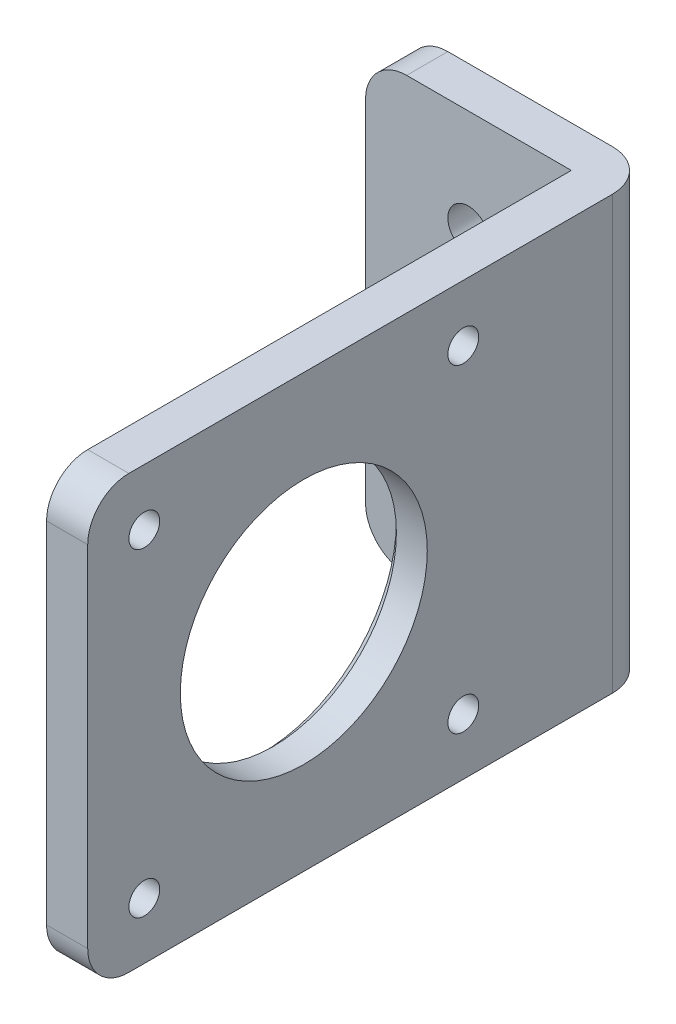
ISO-10303-21;
HEADER;
FILE_DESCRIPTION(('STEP AP214'),'2;1');
FILE_NAME('part.step','',(''),(''),'','','');
FILE_SCHEMA(('AUTOMOTIVE_DESIGN { 1 0 10303 214 1 1 1 1 }'));
ENDSEC;
DATA;
#1=APPLICATION_CONTEXT('core data for automotive mechanical design processes');
#2=APPLICATION_PROTOCOL_DEFINITION('international standard','automotive_design',2000,#1);
#3=PRODUCT_CONTEXT('',#1,'mechanical');
#4=PRODUCT('Part','Part','',(#3));
#5=PRODUCT_RELATED_PRODUCT_CATEGORY('part','',(#4));
#6=PRODUCT_DEFINITION_FORMATION('','',#4);
#7=PRODUCT_DEFINITION_CONTEXT('part definition',#1,'design');
#8=PRODUCT_DEFINITION('design','',#6,#7);
#9=PRODUCT_DEFINITION_SHAPE('','',#8);
#10=(LENGTH_UNIT() NAMED_UNIT(*) SI_UNIT(.MILLI.,.METRE.));
#11=(NAMED_UNIT(*) PLANE_ANGLE_UNIT() SI_UNIT($,.RADIAN.));
#12=(NAMED_UNIT(*) SI_UNIT($,.STERADIAN.) SOLID_ANGLE_UNIT());
#13=UNCERTAINTY_MEASURE_WITH_UNIT(LENGTH_MEASURE(1.E-05),#10,'distance_accuracy_value','');
#14=(GEOMETRIC_REPRESENTATION_CONTEXT(3) GLOBAL_UNCERTAINTY_ASSIGNED_CONTEXT((#13)) GLOBAL_UNIT_ASSIGNED_CONTEXT((#10,
#11,#12)) REPRESENTATION_CONTEXT('',''));
#15=CARTESIAN_POINT('',(0.,0.,0.));
#16=DIRECTION('',(0.,0.,1.));
#17=DIRECTION('',(1.,0.,0.));
#18=AXIS2_PLACEMENT_3D('',#15,#16,#17);
#19=CARTESIAN_POINT('',(-20.,42.,-55.));
#20=DIRECTION('',(0.,0.,1.));
#21=DIRECTION('',(1.,0.,0.));
#22=AXIS2_PLACEMENT_3D('',#19,#20,#21);
#23=PLANE('',#22);
#24=DIRECTION('',(-1.,0.,0.));
#25=VECTOR('',#24,1.);
#26=CARTESIAN_POINT('',(-20.,42.,-55.));
#27=LINE('',#26,#25);
#28=CARTESIAN_POINT('',(0.,42.,-55.));
#29=VERTEX_POINT('',#28);
#30=CARTESIAN_POINT('',(-16.,42.,-55.));
#31=VERTEX_POINT('',#30);
#32=EDGE_CURVE('E140',#29,#31,#27,.T.);
#33=ORIENTED_EDGE('',*,*,#32,.F.);
#34=DIRECTION('',(0.,-1.,0.));
#35=VECTOR('',#34,1.);
#36=CARTESIAN_POINT('',(0.,42.,-55.));
#37=LINE('',#36,#35);
#38=CARTESIAN_POINT('',(0.,0.,-55.));
#39=VERTEX_POINT('',#38);
#40=EDGE_CURVE('E206',#29,#39,#37,.T.);
#41=ORIENTED_EDGE('',*,*,#40,.T.);
#42=DIRECTION('',(-1.,0.,0.));
#43=VECTOR('',#42,1.);
#44=CARTESIAN_POINT('',(-20.,0.,-55.));
#45=LINE('',#44,#43);
#46=CARTESIAN_POINT('',(-16.,0.,-55.));
#47=VERTEX_POINT('',#46);
#48=EDGE_CURVE('E171',#39,#47,#45,.T.);
#49=ORIENTED_EDGE('',*,*,#48,.T.);
#50=CARTESIAN_POINT('',(-16.,4.,-55.));
#51=DIRECTION('',(0.,0.,1.));
#52=DIRECTION('',(1.,0.,0.));
#53=AXIS2_PLACEMENT_3D('',#50,#51,#52);
#54=CIRCLE('',#53,4.);
#55=CARTESIAN_POINT('',(-20.,4.00000000000001,-55.));
#56=VERTEX_POINT('',#55);
#57=EDGE_CURVE('E203',#47,#56,#54,.F.);
#58=ORIENTED_EDGE('',*,*,#57,.T.);
#59=DIRECTION('',(0.,-1.,0.));
#60=VECTOR('',#59,1.);
#61=CARTESIAN_POINT('',(-20.,42.,-55.));
#62=LINE('',#61,#60);
#63=CARTESIAN_POINT('',(-20.,38.,-55.));
#64=VERTEX_POINT('',#63);
#65=EDGE_CURVE('E184',#64,#56,#62,.T.);
#66=ORIENTED_EDGE('',*,*,#65,.F.);
#67=CARTESIAN_POINT('',(-16.,38.,-55.));
#68=DIRECTION('',(0.,0.,1.));
#69=DIRECTION('',(1.,0.,0.));
#70=AXIS2_PLACEMENT_3D('',#67,#68,#69);
#71=CIRCLE('',#70,4.);
#72=EDGE_CURVE('E200',#64,#31,#71,.F.);
#73=ORIENTED_EDGE('',*,*,#72,.T.);
#74=EDGE_LOOP('',(#33,#41,#49,#58,#66,#73));
#75=FACE_BOUND('',#74,.T.);
#76=CARTESIAN_POINT('',(-10.,9.99999999999999,-55.));
#77=DIRECTION('',(0.,0.,1.));
#78=DIRECTION('',(1.,0.,0.));
#79=AXIS2_PLACEMENT_3D('',#76,#77,#78);
#80=CIRCLE('',#79,2.);
#81=CARTESIAN_POINT('',(-8.00000000000003,9.99999999999999,-55.));
#82=VERTEX_POINT('',#81);
#83=EDGE_CURVE('E318',#82,#82,#80,.F.);
#84=ORIENTED_EDGE('',*,*,#83,.F.);
#85=EDGE_LOOP('',(#84));
#86=FACE_BOUND('',#85,.T.);
#87=CARTESIAN_POINT('',(-10.,32.,-55.));
#88=DIRECTION('',(0.,0.,1.));
#89=DIRECTION('',(1.,0.,0.));
#90=AXIS2_PLACEMENT_3D('',#87,#88,#89);
#91=CIRCLE('',#90,2.);
#92=CARTESIAN_POINT('',(-8.,32.,-55.));
#93=VERTEX_POINT('',#92);
#94=EDGE_CURVE('E291',#93,#93,#91,.T.);
#95=ORIENTED_EDGE('',*,*,#94,.T.);
#96=EDGE_LOOP('',(#95));
#97=FACE_BOUND('',#96,.T.);
#98=ADVANCED_FACE('F45',(#75,#86,#97),#23,.F.);
#99=CARTESIAN_POINT('',(0.,42.,-51.));
#100=DIRECTION('',(0.,0.,-1.));
#101=DIRECTION('',(-1.,0.,0.));
#102=AXIS2_PLACEMENT_3D('',#99,#100,#101);
#103=PLANE('',#102);
#104=DIRECTION('',(0.,-1.,0.));
#105=VECTOR('',#104,1.);
#106=CARTESIAN_POINT('',(-20.,42.,-51.));
#107=LINE('',#106,#105);
#108=CARTESIAN_POINT('',(-20.,38.,-51.));
#109=VERTEX_POINT('',#108);
#110=CARTESIAN_POINT('',(-20.,4.00000000000001,-51.));
#111=VERTEX_POINT('',#110);
#112=EDGE_CURVE('E152',#109,#111,#107,.T.);
#113=ORIENTED_EDGE('',*,*,#112,.T.);
#114=CARTESIAN_POINT('',(-16.,4.,-51.));
#115=DIRECTION('',(0.,0.,-1.));
#116=DIRECTION('',(-1.,0.,0.));
#117=AXIS2_PLACEMENT_3D('',#114,#115,#116);
#118=CIRCLE('',#117,4.);
#119=CARTESIAN_POINT('',(-16.,0.,-51.));
#120=VERTEX_POINT('',#119);
#121=EDGE_CURVE('E12',#111,#120,#118,.F.);
#122=ORIENTED_EDGE('',*,*,#121,.T.);
#123=DIRECTION('',(1.,0.,0.));
#124=VECTOR('',#123,1.);
#125=CARTESIAN_POINT('',(0.,0.,-51.));
#126=LINE('',#125,#124);
#127=CARTESIAN_POINT('',(0.,0.,-51.));
#128=VERTEX_POINT('',#127);
#129=EDGE_CURVE('E147',#120,#128,#126,.T.);
#130=ORIENTED_EDGE('',*,*,#129,.T.);
#131=DIRECTION('',(0.,-1.,0.));
#132=VECTOR('',#131,1.);
#133=CARTESIAN_POINT('',(0.,42.,-51.));
#134=LINE('',#133,#132);
#135=CARTESIAN_POINT('',(0.,42.,-51.));
#136=VERTEX_POINT('',#135);
#137=EDGE_CURVE('E143',#136,#128,#134,.T.);
#138=ORIENTED_EDGE('',*,*,#137,.F.);
#139=DIRECTION('',(1.,0.,0.));
#140=VECTOR('',#139,1.);
#141=CARTESIAN_POINT('',(0.,42.,-51.));
#142=LINE('',#141,#140);
#143=CARTESIAN_POINT('',(-16.,42.,-51.));
#144=VERTEX_POINT('',#143);
#145=EDGE_CURVE('E128',#144,#136,#142,.T.);
#146=ORIENTED_EDGE('',*,*,#145,.F.);
#147=CARTESIAN_POINT('',(-16.,38.,-51.));
#148=DIRECTION('',(0.,0.,-1.));
#149=DIRECTION('',(-1.,0.,0.));
#150=AXIS2_PLACEMENT_3D('',#147,#148,#149);
#151=CIRCLE('',#150,4.);
#152=EDGE_CURVE('E54',#144,#109,#151,.F.);
#153=ORIENTED_EDGE('',*,*,#152,.T.);
#154=EDGE_LOOP('',(#113,#122,#130,#138,#146,#153));
#155=FACE_BOUND('',#154,.T.);
#156=CARTESIAN_POINT('',(-10.,9.99999999999999,-51.));
#157=DIRECTION('',(0.,0.,1.));
#158=DIRECTION('',(1.,0.,0.));
#159=AXIS2_PLACEMENT_3D('',#156,#157,#158);
#160=CIRCLE('',#159,2.);
#161=CARTESIAN_POINT('',(-8.00000000000003,9.99999999999999,-51.));
#162=VERTEX_POINT('',#161);
#163=EDGE_CURVE('E322',#162,#162,#160,.F.);
#164=ORIENTED_EDGE('',*,*,#163,.T.);
#165=EDGE_LOOP('',(#164));
#166=FACE_BOUND('',#165,.T.);
#167=CARTESIAN_POINT('',(-10.,32.,-51.));
#168=DIRECTION('',(0.,0.,1.));
#169=DIRECTION('',(1.,0.,0.));
#170=AXIS2_PLACEMENT_3D('',#167,#168,#169);
#171=CIRCLE('',#170,2.);
#172=CARTESIAN_POINT('',(-8.,32.,-51.));
#173=VERTEX_POINT('',#172);
#174=EDGE_CURVE('E326',#173,#173,#171,.T.);
#175=ORIENTED_EDGE('',*,*,#174,.F.);
#176=EDGE_LOOP('',(#175));
#177=FACE_BOUND('',#176,.T.);
#178=ADVANCED_FACE('F144',(#155,#166,#177),#103,.F.);
#179=CARTESIAN_POINT('',(3.99999999999999,42.,-55.));
#180=DIRECTION('',(-1.,0.,0.));
#181=DIRECTION('',(0.,0.,1.));
#182=AXIS2_PLACEMENT_3D('',#179,#180,#181);
#183=PLANE('',#182);
#184=CARTESIAN_POINT('',(4.,5.5,-36.5));
#185=DIRECTION('',(-1.,0.,0.));
#186=DIRECTION('',(0.,0.,1.));
#187=AXIS2_PLACEMENT_3D('',#184,#185,#186);
#188=CIRCLE('',#187,1.5);
#189=CARTESIAN_POINT('',(4.,5.5,-35.));
#190=VERTEX_POINT('',#189);
#191=EDGE_CURVE('E286',#190,#190,#188,.T.);
#192=ORIENTED_EDGE('',*,*,#191,.T.);
#193=EDGE_LOOP('',(#192));
#194=FACE_BOUND('',#193,.T.);
#195=CARTESIAN_POINT('',(4.,36.5,-5.50000000000004));
#196=DIRECTION('',(-1.,0.,0.));
#197=DIRECTION('',(0.,0.,1.));
#198=AXIS2_PLACEMENT_3D('',#195,#196,#197);
#199=CIRCLE('',#198,1.5);
#200=CARTESIAN_POINT('',(4.,36.5,-4.00000000000004));
#201=VERTEX_POINT('',#200);
#202=EDGE_CURVE('E303',#201,#201,#199,.T.);
#203=ORIENTED_EDGE('',*,*,#202,.T.);
#204=EDGE_LOOP('',(#203));
#205=FACE_BOUND('',#204,.T.);
#206=CARTESIAN_POINT('',(4.,21.,-21.));
#207=DIRECTION('',(-1.,0.,0.));
#208=DIRECTION('',(0.,0.,1.));
#209=AXIS2_PLACEMENT_3D('',#206,#207,#208);
#210=CIRCLE('',#209,12.);
#211=CARTESIAN_POINT('',(4.,21.,-9.00000000000001));
#212=VERTEX_POINT('',#211);
#213=EDGE_CURVE('E172',#212,#212,#210,.T.);
#214=ORIENTED_EDGE('',*,*,#213,.T.);
#215=EDGE_LOOP('',(#214));
#216=FACE_BOUND('',#215,.T.);
#217=DIRECTION('',(0.,0.,-1.));
#218=VECTOR('',#217,1.);
#219=CARTESIAN_POINT('',(3.99999999999999,0.,-55.));
#220=LINE('',#219,#218);
#221=CARTESIAN_POINT('',(4.,0.,-4.));
#222=VERTEX_POINT('',#221);
#223=CARTESIAN_POINT('',(3.99999999999999,0.,-51.));
#224=VERTEX_POINT('',#223);
#225=EDGE_CURVE('E167',#222,#224,#220,.T.);
#226=ORIENTED_EDGE('',*,*,#225,.T.);
#227=DIRECTION('',(0.,-1.,0.));
#228=VECTOR('',#227,1.);
#229=CARTESIAN_POINT('',(3.99999999999999,42.,-51.));
#230=LINE('',#229,#228);
#231=CARTESIAN_POINT('',(3.99999999999999,42.,-51.));
#232=VERTEX_POINT('',#231);
#233=EDGE_CURVE('E225',#224,#232,#230,.F.);
#234=ORIENTED_EDGE('',*,*,#233,.T.);
#235=DIRECTION('',(0.,0.,-1.));
#236=VECTOR('',#235,1.);
#237=CARTESIAN_POINT('',(3.99999999999999,42.,-55.));
#238=LINE('',#237,#236);
#239=CARTESIAN_POINT('',(4.,42.,-4.));
#240=VERTEX_POINT('',#239);
#241=EDGE_CURVE('E180',#240,#232,#238,.T.);
#242=ORIENTED_EDGE('',*,*,#241,.F.);
#243=CARTESIAN_POINT('',(4.,38.,-4.));
#244=DIRECTION('',(-1.,0.,0.));
#245=DIRECTION('',(0.,0.,1.));
#246=AXIS2_PLACEMENT_3D('',#243,#244,#245);
#247=CIRCLE('',#246,4.);
#248=CARTESIAN_POINT('',(4.,38.,0.));
#249=VERTEX_POINT('',#248);
#250=EDGE_CURVE('E219',#240,#249,#247,.F.);
#251=ORIENTED_EDGE('',*,*,#250,.T.);
#252=DIRECTION('',(0.,-1.,0.));
#253=VECTOR('',#252,1.);
#254=CARTESIAN_POINT('',(4.,42.,0.));
#255=LINE('',#254,#253);
#256=CARTESIAN_POINT('',(4.,4.00000000000001,0.));
#257=VERTEX_POINT('',#256);
#258=EDGE_CURVE('E188',#249,#257,#255,.T.);
#259=ORIENTED_EDGE('',*,*,#258,.T.);
#260=CARTESIAN_POINT('',(4.,4.,-4.));
#261=DIRECTION('',(-1.,0.,0.));
#262=DIRECTION('',(0.,0.,1.));
#263=AXIS2_PLACEMENT_3D('',#260,#261,#262);
#264=CIRCLE('',#263,4.);
#265=EDGE_CURVE('E222',#257,#222,#264,.F.);
#266=ORIENTED_EDGE('',*,*,#265,.T.);
#267=EDGE_LOOP('',(#226,#234,#242,#251,#259,#266));
#268=FACE_BOUND('',#267,.T.);
#269=CARTESIAN_POINT('',(4.,36.5,-36.5));
#270=DIRECTION('',(-1.,0.,0.));
#271=DIRECTION('',(0.,0.,1.));
#272=AXIS2_PLACEMENT_3D('',#269,#270,#271);
#273=CIRCLE('',#272,1.5);
#274=CARTESIAN_POINT('',(4.,36.5,-35.));
#275=VERTEX_POINT('',#274);
#276=EDGE_CURVE('E311',#275,#275,#273,.F.);
#277=ORIENTED_EDGE('',*,*,#276,.F.);
#278=EDGE_LOOP('',(#277));
#279=FACE_BOUND('',#278,.T.);
#280=CARTESIAN_POINT('',(4.,5.5,-5.50000000000001));
#281=DIRECTION('',(-1.,0.,0.));
#282=DIRECTION('',(0.,0.,1.));
#283=AXIS2_PLACEMENT_3D('',#280,#281,#282);
#284=CIRCLE('',#283,1.5);
#285=CARTESIAN_POINT('',(4.,5.5,-4.00000000000001));
#286=VERTEX_POINT('',#285);
#287=EDGE_CURVE('E295',#286,#286,#284,.F.);
#288=ORIENTED_EDGE('',*,*,#287,.F.);
#289=EDGE_LOOP('',(#288));
#290=FACE_BOUND('',#289,.T.);
#291=ADVANCED_FACE('F273',(#194,#205,#216,#268,#279,#290),#183,.F.);
#292=CARTESIAN_POINT('',(0.,42.,0.));
#293=DIRECTION('',(1.,0.,0.));
#294=DIRECTION('',(0.,0.,-1.));
#295=AXIS2_PLACEMENT_3D('',#292,#293,#294);
#296=PLANE('',#295);
#297=CARTESIAN_POINT('',(0.,21.,-21.));
#298=DIRECTION('',(1.,0.,0.));
#299=DIRECTION('',(0.,0.,-1.));
#300=AXIS2_PLACEMENT_3D('',#297,#298,#299);
#301=CIRCLE('',#300,13.);
#302=CARTESIAN_POINT('',(0.,21.,-34.));
#303=VERTEX_POINT('',#302);
#304=EDGE_CURVE('E196',#303,#303,#301,.T.);
#305=ORIENTED_EDGE('',*,*,#304,.T.);
#306=EDGE_LOOP('',(#305));
#307=FACE_BOUND('',#306,.T.);
#308=CARTESIAN_POINT('',(0.,5.5,-36.5));
#309=DIRECTION('',(-1.,0.,0.));
#310=DIRECTION('',(0.,0.,1.));
#311=AXIS2_PLACEMENT_3D('',#308,#309,#310);
#312=CIRCLE('',#311,1.5);
#313=CARTESIAN_POINT('',(0.,5.5,-35.));
#314=VERTEX_POINT('',#313);
#315=EDGE_CURVE('E290',#314,#314,#312,.T.);
#316=ORIENTED_EDGE('',*,*,#315,.F.);
#317=EDGE_LOOP('',(#316));
#318=FACE_BOUND('',#317,.T.);
#319=CARTESIAN_POINT('',(0.,36.5,-5.50000000000004));
#320=DIRECTION('',(-1.,0.,0.));
#321=DIRECTION('',(0.,0.,1.));
#322=AXIS2_PLACEMENT_3D('',#319,#320,#321);
#323=CIRCLE('',#322,1.5);
#324=CARTESIAN_POINT('',(0.,36.5,-4.00000000000004));
#325=VERTEX_POINT('',#324);
#326=EDGE_CURVE('E307',#325,#325,#323,.T.);
#327=ORIENTED_EDGE('',*,*,#326,.F.);
#328=EDGE_LOOP('',(#327));
#329=FACE_BOUND('',#328,.T.);
#330=DIRECTION('',(0.,0.,1.));
#331=VECTOR('',#330,1.);
#332=CARTESIAN_POINT('',(0.,0.,0.));
#333=LINE('',#332,#331);
#334=CARTESIAN_POINT('',(0.,0.,-4.));
#335=VERTEX_POINT('',#334);
#336=EDGE_CURVE('E178',#128,#335,#333,.T.);
#337=ORIENTED_EDGE('',*,*,#336,.T.);
#338=CARTESIAN_POINT('',(0.,4.,-4.));
#339=DIRECTION('',(1.,0.,0.));
#340=DIRECTION('',(0.,0.,-1.));
#341=AXIS2_PLACEMENT_3D('',#338,#339,#340);
#342=CIRCLE('',#341,4.);
#343=CARTESIAN_POINT('',(0.,4.00000000000001,0.));
#344=VERTEX_POINT('',#343);
#345=EDGE_CURVE('E245',#335,#344,#342,.F.);
#346=ORIENTED_EDGE('',*,*,#345,.T.);
#347=DIRECTION('',(0.,-1.,0.));
#348=VECTOR('',#347,1.);
#349=CARTESIAN_POINT('',(0.,42.,0.));
#350=LINE('',#349,#348);
#351=CARTESIAN_POINT('',(0.,38.,0.));
#352=VERTEX_POINT('',#351);
#353=EDGE_CURVE('E153',#352,#344,#350,.T.);
#354=ORIENTED_EDGE('',*,*,#353,.F.);
#355=CARTESIAN_POINT('',(0.,38.,-4.));
#356=DIRECTION('',(1.,0.,0.));
#357=DIRECTION('',(0.,0.,-1.));
#358=AXIS2_PLACEMENT_3D('',#355,#356,#357);
#359=CIRCLE('',#358,4.);
#360=CARTESIAN_POINT('',(0.,42.,-4.));
#361=VERTEX_POINT('',#360);
#362=EDGE_CURVE('E159',#352,#361,#359,.F.);
#363=ORIENTED_EDGE('',*,*,#362,.T.);
#364=DIRECTION('',(0.,0.,1.));
#365=VECTOR('',#364,1.);
#366=CARTESIAN_POINT('',(0.,42.,0.));
#367=LINE('',#366,#365);
#368=EDGE_CURVE('E134',#136,#361,#367,.T.);
#369=ORIENTED_EDGE('',*,*,#368,.F.);
#370=ORIENTED_EDGE('',*,*,#137,.T.);
#371=EDGE_LOOP('',(#337,#346,#354,#363,#369,#370));
#372=FACE_BOUND('',#371,.T.);
#373=CARTESIAN_POINT('',(0.,36.5,-36.5));
#374=DIRECTION('',(-1.,0.,0.));
#375=DIRECTION('',(0.,0.,1.));
#376=AXIS2_PLACEMENT_3D('',#373,#374,#375);
#377=CIRCLE('',#376,1.5);
#378=CARTESIAN_POINT('',(0.,36.5,-35.));
#379=VERTEX_POINT('',#378);
#380=EDGE_CURVE('E285',#379,#379,#377,.F.);
#381=ORIENTED_EDGE('',*,*,#380,.T.);
#382=EDGE_LOOP('',(#381));
#383=FACE_BOUND('',#382,.T.);
#384=CARTESIAN_POINT('',(0.,5.5,-5.50000000000001));
#385=DIRECTION('',(-1.,0.,0.));
#386=DIRECTION('',(0.,0.,1.));
#387=AXIS2_PLACEMENT_3D('',#384,#385,#386);
#388=CIRCLE('',#387,1.5);
#389=CARTESIAN_POINT('',(0.,5.5,-4.00000000000001));
#390=VERTEX_POINT('',#389);
#391=EDGE_CURVE('E299',#390,#390,#388,.F.);
#392=ORIENTED_EDGE('',*,*,#391,.T.);
#393=EDGE_LOOP('',(#392));
#394=FACE_BOUND('',#393,.T.);
#395=ADVANCED_FACE('F155',(#307,#318,#329,#372,#383,#394),#296,.F.);
#396=CARTESIAN_POINT('',(4.,42.,0.));
#397=DIRECTION('',(0.,0.,-1.));
#398=DIRECTION('',(-1.,0.,0.));
#399=AXIS2_PLACEMENT_3D('',#396,#397,#398);
#400=PLANE('',#399);
#401=ORIENTED_EDGE('',*,*,#353,.T.);
#402=DIRECTION('',(1.,0.,0.));
#403=VECTOR('',#402,1.);
#404=CARTESIAN_POINT('',(4.,4.,0.));
#405=LINE('',#404,#403);
#406=EDGE_CURVE('E239',#344,#257,#405,.T.);
#407=ORIENTED_EDGE('',*,*,#406,.T.);
#408=ORIENTED_EDGE('',*,*,#258,.F.);
#409=DIRECTION('',(1.,0.,0.));
#410=VECTOR('',#409,1.);
#411=CARTESIAN_POINT('',(4.,38.,0.));
#412=LINE('',#411,#410);
#413=EDGE_CURVE('E236',#249,#352,#412,.F.);
#414=ORIENTED_EDGE('',*,*,#413,.T.);
#415=EDGE_LOOP('',(#401,#407,#408,#414));
#416=FACE_BOUND('',#415,.T.);
#417=ADVANCED_FACE('F356',(#416),#400,.F.);
#418=CARTESIAN_POINT('',(-20.,42.,-51.));
#419=DIRECTION('',(1.,0.,0.));
#420=DIRECTION('',(0.,0.,-1.));
#421=AXIS2_PLACEMENT_3D('',#418,#419,#420);
#422=PLANE('',#421);
#423=ORIENTED_EDGE('',*,*,#65,.T.);
#424=DIRECTION('',(0.,0.,1.));
#425=VECTOR('',#424,1.);
#426=CARTESIAN_POINT('',(-20.,4.,-51.));
#427=LINE('',#426,#425);
#428=EDGE_CURVE('E251',#56,#111,#427,.T.);
#429=ORIENTED_EDGE('',*,*,#428,.T.);
#430=ORIENTED_EDGE('',*,*,#112,.F.);
#431=DIRECTION('',(0.,0.,1.));
#432=VECTOR('',#431,1.);
#433=CARTESIAN_POINT('',(-20.,38.,-51.));
#434=LINE('',#433,#432);
#435=EDGE_CURVE('E248',#109,#64,#434,.F.);
#436=ORIENTED_EDGE('',*,*,#435,.T.);
#437=EDGE_LOOP('',(#423,#429,#430,#436));
#438=FACE_BOUND('',#437,.T.);
#439=ADVANCED_FACE('F255',(#438),#422,.F.);
#440=CARTESIAN_POINT('',(0.,42.,0.));
#441=DIRECTION('',(0.,-1.,0.));
#442=DIRECTION('',(0.,0.,-1.));
#443=AXIS2_PLACEMENT_3D('',#440,#441,#442);
#444=PLANE('',#443);
#445=ORIENTED_EDGE('',*,*,#241,.T.);
#446=CARTESIAN_POINT('',(0.,42.,-51.));
#447=DIRECTION('',(0.,-1.,0.));
#448=DIRECTION('',(0.,0.,-1.));
#449=AXIS2_PLACEMENT_3D('',#446,#447,#448);
#450=CIRCLE('',#449,4.);
#451=EDGE_CURVE('E233',#232,#29,#450,.F.);
#452=ORIENTED_EDGE('',*,*,#451,.T.);
#453=ORIENTED_EDGE('',*,*,#32,.T.);
#454=DIRECTION('',(0.,0.,1.));
#455=VECTOR('',#454,1.);
#456=CARTESIAN_POINT('',(-16.,42.,0.));
#457=LINE('',#456,#455);
#458=EDGE_CURVE('E138',#31,#144,#457,.T.);
#459=ORIENTED_EDGE('',*,*,#458,.T.);
#460=ORIENTED_EDGE('',*,*,#145,.T.);
#461=ORIENTED_EDGE('',*,*,#368,.T.);
#462=DIRECTION('',(1.,0.,0.));
#463=VECTOR('',#462,1.);
#464=CARTESIAN_POINT('',(0.,42.,-4.));
#465=LINE('',#464,#463);
#466=EDGE_CURVE('E230',#361,#240,#465,.T.);
#467=ORIENTED_EDGE('',*,*,#466,.T.);
#468=EDGE_LOOP('',(#445,#452,#453,#459,#460,#461,#467));
#469=FACE_BOUND('',#468,.T.);
#470=ADVANCED_FACE('F131',(#469),#444,.F.);
#471=CARTESIAN_POINT('',(0.,0.,0.));
#472=DIRECTION('',(0.,-1.,0.));
#473=DIRECTION('',(0.,0.,-1.));
#474=AXIS2_PLACEMENT_3D('',#471,#472,#473);
#475=PLANE('',#474);
#476=ORIENTED_EDGE('',*,*,#48,.F.);
#477=CARTESIAN_POINT('',(0.,0.,-51.));
#478=DIRECTION('',(0.,-1.,0.));
#479=DIRECTION('',(0.,0.,-1.));
#480=AXIS2_PLACEMENT_3D('',#477,#478,#479);
#481=CIRCLE('',#480,4.);
#482=EDGE_CURVE('E216',#39,#224,#481,.T.);
#483=ORIENTED_EDGE('',*,*,#482,.T.);
#484=ORIENTED_EDGE('',*,*,#225,.F.);
#485=DIRECTION('',(1.,0.,0.));
#486=VECTOR('',#485,1.);
#487=CARTESIAN_POINT('',(0.,0.,-4.));
#488=LINE('',#487,#486);
#489=EDGE_CURVE('E213',#222,#335,#488,.F.);
#490=ORIENTED_EDGE('',*,*,#489,.T.);
#491=ORIENTED_EDGE('',*,*,#336,.F.);
#492=ORIENTED_EDGE('',*,*,#129,.F.);
#493=DIRECTION('',(0.,0.,1.));
#494=VECTOR('',#493,1.);
#495=CARTESIAN_POINT('',(-16.,0.,-55.));
#496=LINE('',#495,#494);
#497=EDGE_CURVE('E210',#120,#47,#496,.F.);
#498=ORIENTED_EDGE('',*,*,#497,.T.);
#499=EDGE_LOOP('',(#476,#483,#484,#490,#491,#492,#498));
#500=FACE_BOUND('',#499,.T.);
#501=ADVANCED_FACE('F261',(#500),#475,.T.);
#502=CARTESIAN_POINT('',(4.,21.,-21.));
#503=DIRECTION('',(-1.,0.,0.));
#504=DIRECTION('',(0.,0.,1.));
#505=AXIS2_PLACEMENT_3D('',#502,#503,#504);
#506=CYLINDRICAL_SURFACE('',#505,12.);
#507=CARTESIAN_POINT('',(1.00000000000002,21.,-21.));
#508=DIRECTION('',(1.,0.,0.));
#509=DIRECTION('',(0.,0.,-1.));
#510=AXIS2_PLACEMENT_3D('',#507,#508,#509);
#511=CIRCLE('',#510,12.);
#512=CARTESIAN_POINT('',(1.00000000000002,21.,-33.));
#513=VERTEX_POINT('',#512);
#514=EDGE_CURVE('E192',#513,#513,#511,.F.);
#515=ORIENTED_EDGE('',*,*,#514,.T.);
#516=EDGE_LOOP('',(#515));
#517=FACE_BOUND('',#516,.T.);
#518=ORIENTED_EDGE('',*,*,#213,.F.);
#519=EDGE_LOOP('',(#518));
#520=FACE_BOUND('',#519,.T.);
#521=ADVANCED_FACE('F412',(#517,#520),#506,.F.);
#522=CARTESIAN_POINT('',(4.,36.5,-36.5));
#523=DIRECTION('',(-1.,0.,0.));
#524=DIRECTION('',(0.,0.,1.));
#525=AXIS2_PLACEMENT_3D('',#522,#523,#524);
#526=CYLINDRICAL_SURFACE('',#525,1.5);
#527=ORIENTED_EDGE('',*,*,#276,.T.);
#528=EDGE_LOOP('',(#527));
#529=FACE_BOUND('',#528,.T.);
#530=ORIENTED_EDGE('',*,*,#380,.F.);
#531=EDGE_LOOP('',(#530));
#532=FACE_BOUND('',#531,.T.);
#533=ADVANCED_FACE('F472',(#529,#532),#526,.F.);
#534=CARTESIAN_POINT('',(4.,36.5,-5.50000000000004));
#535=DIRECTION('',(-1.,0.,0.));
#536=DIRECTION('',(0.,0.,1.));
#537=AXIS2_PLACEMENT_3D('',#534,#535,#536);
#538=CYLINDRICAL_SURFACE('',#537,1.5);
#539=ORIENTED_EDGE('',*,*,#202,.F.);
#540=EDGE_LOOP('',(#539));
#541=FACE_BOUND('',#540,.T.);
#542=ORIENTED_EDGE('',*,*,#326,.T.);
#543=EDGE_LOOP('',(#542));
#544=FACE_BOUND('',#543,.T.);
#545=ADVANCED_FACE('F508',(#541,#544),#538,.F.);
#546=CARTESIAN_POINT('',(4.,5.5,-5.50000000000001));
#547=DIRECTION('',(-1.,0.,0.));
#548=DIRECTION('',(0.,0.,1.));
#549=AXIS2_PLACEMENT_3D('',#546,#547,#548);
#550=CYLINDRICAL_SURFACE('',#549,1.5);
#551=ORIENTED_EDGE('',*,*,#287,.T.);
#552=EDGE_LOOP('',(#551));
#553=FACE_BOUND('',#552,.T.);
#554=ORIENTED_EDGE('',*,*,#391,.F.);
#555=EDGE_LOOP('',(#554));
#556=FACE_BOUND('',#555,.T.);
#557=ADVANCED_FACE('F498',(#553,#556),#550,.F.);
#558=CARTESIAN_POINT('',(4.,5.5,-36.5));
#559=DIRECTION('',(-1.,0.,0.));
#560=DIRECTION('',(0.,0.,1.));
#561=AXIS2_PLACEMENT_3D('',#558,#559,#560);
#562=CYLINDRICAL_SURFACE('',#561,1.5);
#563=ORIENTED_EDGE('',*,*,#191,.F.);
#564=EDGE_LOOP('',(#563));
#565=FACE_BOUND('',#564,.T.);
#566=ORIENTED_EDGE('',*,*,#315,.T.);
#567=EDGE_LOOP('',(#566));
#568=FACE_BOUND('',#567,.T.);
#569=ADVANCED_FACE('F489',(#565,#568),#562,.F.);
#570=CARTESIAN_POINT('',(-10.,9.99999999999999,-55.));
#571=DIRECTION('',(0.,0.,1.));
#572=DIRECTION('',(1.,0.,0.));
#573=AXIS2_PLACEMENT_3D('',#570,#571,#572);
#574=CYLINDRICAL_SURFACE('',#573,2.);
#575=ORIENTED_EDGE('',*,*,#83,.T.);
#576=EDGE_LOOP('',(#575));
#577=FACE_BOUND('',#576,.T.);
#578=ORIENTED_EDGE('',*,*,#163,.F.);
#579=EDGE_LOOP('',(#578));
#580=FACE_BOUND('',#579,.T.);
#581=ADVANCED_FACE('F339',(#577,#580),#574,.F.);
#582=CARTESIAN_POINT('',(-10.,32.,-55.));
#583=DIRECTION('',(0.,0.,1.));
#584=DIRECTION('',(1.,0.,0.));
#585=AXIS2_PLACEMENT_3D('',#582,#583,#584);
#586=CYLINDRICAL_SURFACE('',#585,2.);
#587=ORIENTED_EDGE('',*,*,#94,.F.);
#588=EDGE_LOOP('',(#587));
#589=FACE_BOUND('',#588,.T.);
#590=ORIENTED_EDGE('',*,*,#174,.T.);
#591=EDGE_LOOP('',(#590));
#592=FACE_BOUND('',#591,.T.);
#593=ADVANCED_FACE('F335',(#589,#592),#586,.F.);
#594=CARTESIAN_POINT('',(1.00000000000002,21.,-21.));
#595=DIRECTION('',(-1.,0.,0.));
#596=DIRECTION('',(0.,0.,1.));
#597=AXIS2_PLACEMENT_3D('',#594,#595,#596);
#598=CONICAL_SURFACE('',#597,12.,0.785398163397455);
#599=ORIENTED_EDGE('',*,*,#304,.F.);
#600=EDGE_LOOP('',(#599));
#601=FACE_BOUND('',#600,.T.);
#602=ORIENTED_EDGE('',*,*,#514,.F.);
#603=EDGE_LOOP('',(#602));
#604=FACE_BOUND('',#603,.T.);
#605=ADVANCED_FACE('F338',(#601,#604),#598,.F.);
#606=CARTESIAN_POINT('',(0.,42.,-51.));
#607=DIRECTION('',(0.,-1.,0.));
#608=DIRECTION('',(0.,0.,-1.));
#609=AXIS2_PLACEMENT_3D('',#606,#607,#608);
#610=CYLINDRICAL_SURFACE('',#609,4.);
#611=ORIENTED_EDGE('',*,*,#451,.F.);
#612=ORIENTED_EDGE('',*,*,#233,.F.);
#613=ORIENTED_EDGE('',*,*,#482,.F.);
#614=ORIENTED_EDGE('',*,*,#40,.F.);
#615=EDGE_LOOP('',(#611,#612,#613,#614));
#616=FACE_BOUND('',#615,.T.);
#617=ADVANCED_FACE('F277',(#616),#610,.T.);
#618=CARTESIAN_POINT('',(4.,4.,-4.));
#619=DIRECTION('',(-1.,0.,0.));
#620=DIRECTION('',(0.,0.,1.));
#621=AXIS2_PLACEMENT_3D('',#618,#619,#620);
#622=CYLINDRICAL_SURFACE('',#621,4.);
#623=ORIENTED_EDGE('',*,*,#345,.F.);
#624=ORIENTED_EDGE('',*,*,#489,.F.);
#625=ORIENTED_EDGE('',*,*,#265,.F.);
#626=ORIENTED_EDGE('',*,*,#406,.F.);
#627=EDGE_LOOP('',(#623,#624,#625,#626));
#628=FACE_BOUND('',#627,.T.);
#629=ADVANCED_FACE('F366',(#628),#622,.T.);
#630=CARTESIAN_POINT('',(0.,38.,-4.));
#631=DIRECTION('',(1.,0.,0.));
#632=DIRECTION('',(0.,0.,-1.));
#633=AXIS2_PLACEMENT_3D('',#630,#631,#632);
#634=CYLINDRICAL_SURFACE('',#633,4.);
#635=ORIENTED_EDGE('',*,*,#362,.F.);
#636=ORIENTED_EDGE('',*,*,#413,.F.);
#637=ORIENTED_EDGE('',*,*,#250,.F.);
#638=ORIENTED_EDGE('',*,*,#466,.F.);
#639=EDGE_LOOP('',(#635,#636,#637,#638));
#640=FACE_BOUND('',#639,.T.);
#641=ADVANCED_FACE('F369',(#640),#634,.T.);
#642=CARTESIAN_POINT('',(-16.,4.,-51.));
#643=DIRECTION('',(0.,0.,-1.));
#644=DIRECTION('',(-1.,0.,0.));
#645=AXIS2_PLACEMENT_3D('',#642,#643,#644);
#646=CYLINDRICAL_SURFACE('',#645,4.);
#647=ORIENTED_EDGE('',*,*,#57,.F.);
#648=ORIENTED_EDGE('',*,*,#497,.F.);
#649=ORIENTED_EDGE('',*,*,#121,.F.);
#650=ORIENTED_EDGE('',*,*,#428,.F.);
#651=EDGE_LOOP('',(#647,#648,#649,#650));
#652=FACE_BOUND('',#651,.T.);
#653=ADVANCED_FACE('F262',(#652),#646,.T.);
#654=CARTESIAN_POINT('',(-16.,38.,0.));
#655=DIRECTION('',(0.,0.,1.));
#656=DIRECTION('',(1.,0.,0.));
#657=AXIS2_PLACEMENT_3D('',#654,#655,#656);
#658=CYLINDRICAL_SURFACE('',#657,4.);
#659=ORIENTED_EDGE('',*,*,#72,.F.);
#660=ORIENTED_EDGE('',*,*,#435,.F.);
#661=ORIENTED_EDGE('',*,*,#152,.F.);
#662=ORIENTED_EDGE('',*,*,#458,.F.);
#663=EDGE_LOOP('',(#659,#660,#661,#662));
#664=FACE_BOUND('',#663,.T.);
#665=ADVANCED_FACE('F47',(#664),#658,.T.);
#666=CLOSED_SHELL('',(#98,#178,#291,#395,#417,#439,#470,#501,#521,#533,#545,#557,#569,#581,#593,
#605,#617,#629,#641,#653,#665));
#667=MANIFOLD_SOLID_BREP('B2',#666);
#668=ADVANCED_BREP_SHAPE_REPRESENTATION('',(#18,#667),#14);
#669=SHAPE_DEFINITION_REPRESENTATION(#9,#668);
ENDSEC;
END-ISO-10303-21;
